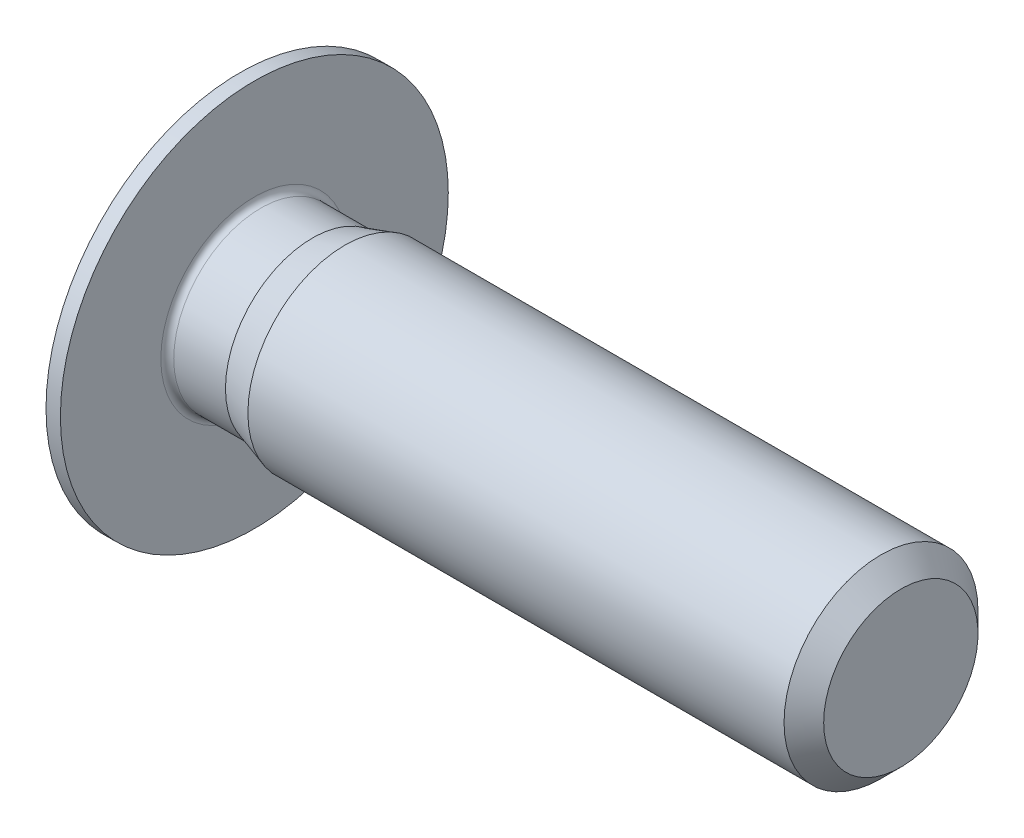
ISO-10303-21;
HEADER;
FILE_DESCRIPTION(('STEP AP214'),'2;1');
FILE_NAME('part.step','',(''),(''),'','','');
FILE_SCHEMA(('AUTOMOTIVE_DESIGN { 1 0 10303 214 1 1 1 1 }'));
ENDSEC;
DATA;
#1=APPLICATION_CONTEXT('core data for automotive mechanical design processes');
#2=APPLICATION_PROTOCOL_DEFINITION('international standard','automotive_design',2000,#1);
#3=PRODUCT_CONTEXT('',#1,'mechanical');
#4=PRODUCT('Part','Part','',(#3));
#5=PRODUCT_RELATED_PRODUCT_CATEGORY('part','',(#4));
#6=PRODUCT_DEFINITION_FORMATION('','',#4);
#7=PRODUCT_DEFINITION_CONTEXT('part definition',#1,'design');
#8=PRODUCT_DEFINITION('design','',#6,#7);
#9=PRODUCT_DEFINITION_SHAPE('','',#8);
#10=(LENGTH_UNIT() NAMED_UNIT(*) SI_UNIT(.MILLI.,.METRE.));
#11=(NAMED_UNIT(*) PLANE_ANGLE_UNIT() SI_UNIT($,.RADIAN.));
#12=(NAMED_UNIT(*) SI_UNIT($,.STERADIAN.) SOLID_ANGLE_UNIT());
#13=UNCERTAINTY_MEASURE_WITH_UNIT(LENGTH_MEASURE(1.E-05),#10,'distance_accuracy_value','');
#14=(GEOMETRIC_REPRESENTATION_CONTEXT(3) GLOBAL_UNCERTAINTY_ASSIGNED_CONTEXT((#13)) GLOBAL_UNIT_ASSIGNED_CONTEXT((#10,
#11,#12)) REPRESENTATION_CONTEXT('',''));
#15=CARTESIAN_POINT('',(0.,0.,0.));
#16=DIRECTION('',(0.,0.,1.));
#17=DIRECTION('',(1.,0.,0.));
#18=AXIS2_PLACEMENT_3D('',#15,#16,#17);
#19=CARTESIAN_POINT('',(-0.8,0.,0.));
#20=DIRECTION('',(1.,0.,0.));
#21=DIRECTION('',(0.,0.,-1.));
#22=AXIS2_PLACEMENT_3D('',#19,#20,#21);
#23=PLANE('',#22);
#24=CARTESIAN_POINT('',(-0.8,0.,0.));
#25=DIRECTION('',(-1.,0.,0.));
#26=DIRECTION('',(0.,0.,1.));
#27=AXIS2_PLACEMENT_3D('',#24,#25,#26);
#28=CIRCLE('',#27,2.);
#29=CARTESIAN_POINT('',(-0.8,0.,2.));
#30=VERTEX_POINT('',#29);
#31=EDGE_CURVE('E146',#30,#30,#28,.T.);
#32=ORIENTED_EDGE('',*,*,#31,.T.);
#33=EDGE_LOOP('',(#32));
#34=FACE_BOUND('',#33,.T.);
#35=DIRECTION('',(0.,0.500000000000001,-0.866025403784438));
#36=VECTOR('',#35,1.);
#37=CARTESIAN_POINT('',(-0.8,-0.86602540378444,0.));
#38=LINE('',#37,#36);
#39=CARTESIAN_POINT('',(-0.8,-0.86602540378444,0.));
#40=VERTEX_POINT('',#39);
#41=CARTESIAN_POINT('',(-0.8,-0.43301270189222,-0.75));
#42=VERTEX_POINT('',#41);
#43=EDGE_CURVE('E414',#40,#42,#38,.T.);
#44=ORIENTED_EDGE('',*,*,#43,.T.);
#45=DIRECTION('',(0.,1.,0.));
#46=VECTOR('',#45,1.);
#47=CARTESIAN_POINT('',(-0.8,-0.43301270189222,-0.75));
#48=LINE('',#47,#46);
#49=CARTESIAN_POINT('',(-0.8,0.43301270189222,-0.75));
#50=VERTEX_POINT('',#49);
#51=EDGE_CURVE('E416',#42,#50,#48,.T.);
#52=ORIENTED_EDGE('',*,*,#51,.T.);
#53=DIRECTION('',(0.,0.500000000000001,0.866025403784438));
#54=VECTOR('',#53,1.);
#55=CARTESIAN_POINT('',(-0.8,0.43301270189222,-0.75));
#56=LINE('',#55,#54);
#57=CARTESIAN_POINT('',(-0.8,0.86602540378444,0.));
#58=VERTEX_POINT('',#57);
#59=EDGE_CURVE('E418',#50,#58,#56,.T.);
#60=ORIENTED_EDGE('',*,*,#59,.T.);
#61=DIRECTION('',(0.,-0.500000000000001,0.866025403784438));
#62=VECTOR('',#61,1.);
#63=CARTESIAN_POINT('',(-0.8,0.86602540378444,0.));
#64=LINE('',#63,#62);
#65=CARTESIAN_POINT('',(-0.8,0.43301270189222,0.75));
#66=VERTEX_POINT('',#65);
#67=EDGE_CURVE('E120',#58,#66,#64,.T.);
#68=ORIENTED_EDGE('',*,*,#67,.T.);
#69=DIRECTION('',(0.,-1.,0.));
#70=VECTOR('',#69,1.);
#71=CARTESIAN_POINT('',(-0.8,0.43301270189222,0.75));
#72=LINE('',#71,#70);
#73=CARTESIAN_POINT('',(-0.8,-0.43301270189222,0.75));
#74=VERTEX_POINT('',#73);
#75=EDGE_CURVE('E411',#66,#74,#72,.T.);
#76=ORIENTED_EDGE('',*,*,#75,.T.);
#77=DIRECTION('',(0.,-0.500000000000001,-0.866025403784438));
#78=VECTOR('',#77,1.);
#79=CARTESIAN_POINT('',(-0.8,-0.43301270189222,0.75));
#80=LINE('',#79,#78);
#81=EDGE_CURVE('E135',#74,#40,#80,.T.);
#82=ORIENTED_EDGE('',*,*,#81,.T.);
#83=EDGE_LOOP('',(#44,#52,#60,#68,#76,#82));
#84=FACE_BOUND('',#83,.T.);
#85=ADVANCED_FACE('F36',(#34,#84),#23,.F.);
#86=CARTESIAN_POINT('',(10.,1.1935,0.));
#87=DIRECTION('',(-1.,0.,0.));
#88=DIRECTION('',(0.,0.,1.));
#89=AXIS2_PLACEMENT_3D('',#86,#87,#88);
#90=PLANE('',#89);
#91=CARTESIAN_POINT('',(10.,0.,0.));
#92=DIRECTION('',(-1.,0.,0.));
#93=DIRECTION('',(0.,0.,1.));
#94=AXIS2_PLACEMENT_3D('',#91,#92,#93);
#95=CIRCLE('',#94,1.1935);
#96=CARTESIAN_POINT('',(10.,0.,1.1935));
#97=VERTEX_POINT('',#96);
#98=EDGE_CURVE('E11',#97,#97,#95,.T.);
#99=ORIENTED_EDGE('',*,*,#98,.F.);
#100=EDGE_LOOP('',(#99));
#101=FACE_BOUND('',#100,.T.);
#102=ADVANCED_FACE('F38',(#101),#90,.F.);
#103=CARTESIAN_POINT('',(10.,0.,0.));
#104=DIRECTION('',(-1.,0.,0.));
#105=DIRECTION('',(0.,0.,1.));
#106=AXIS2_PLACEMENT_3D('',#103,#104,#105);
#107=CONICAL_SURFACE('',#106,1.1935,0.785398163397449);
#108=CARTESIAN_POINT('',(9.6935,0.,0.));
#109=DIRECTION('',(-1.,0.,0.));
#110=DIRECTION('',(0.,0.,1.));
#111=AXIS2_PLACEMENT_3D('',#108,#109,#110);
#112=CIRCLE('',#111,1.5);
#113=CARTESIAN_POINT('',(9.6935,0.,1.5));
#114=VERTEX_POINT('',#113);
#115=EDGE_CURVE('E44',#114,#114,#112,.T.);
#116=ORIENTED_EDGE('',*,*,#115,.F.);
#117=EDGE_LOOP('',(#116));
#118=FACE_BOUND('',#117,.T.);
#119=ORIENTED_EDGE('',*,*,#98,.T.);
#120=EDGE_LOOP('',(#119));
#121=FACE_BOUND('',#120,.T.);
#122=ADVANCED_FACE('F172',(#118,#121),#107,.T.);
#123=CARTESIAN_POINT('',(10.,0.,0.));
#124=DIRECTION('',(-1.,0.,0.));
#125=DIRECTION('',(0.,0.,1.));
#126=AXIS2_PLACEMENT_3D('',#123,#124,#125);
#127=CYLINDRICAL_SURFACE('',#126,1.5);
#128=CARTESIAN_POINT('',(1.4,0.,0.));
#129=DIRECTION('',(-1.,0.,0.));
#130=DIRECTION('',(0.,0.,1.));
#131=AXIS2_PLACEMENT_3D('',#128,#129,#130);
#132=CIRCLE('',#131,1.5);
#133=CARTESIAN_POINT('',(1.4,0.,1.5));
#134=VERTEX_POINT('',#133);
#135=EDGE_CURVE('E165',#134,#134,#132,.T.);
#136=ORIENTED_EDGE('',*,*,#135,.F.);
#137=EDGE_LOOP('',(#136));
#138=FACE_BOUND('',#137,.T.);
#139=ORIENTED_EDGE('',*,*,#115,.T.);
#140=EDGE_LOOP('',(#139));
#141=FACE_BOUND('',#140,.T.);
#142=ADVANCED_FACE('F170',(#138,#141),#127,.T.);
#143=CARTESIAN_POINT('',(1.4,0.,0.));
#144=DIRECTION('',(1.,0.,0.));
#145=DIRECTION('',(0.,0.,-1.));
#146=AXIS2_PLACEMENT_3D('',#143,#144,#145);
#147=CONICAL_SURFACE('',#146,1.5,0.297409377680196);
#148=CARTESIAN_POINT('',(0.9,0.,0.));
#149=DIRECTION('',(-1.,0.,0.));
#150=DIRECTION('',(0.,0.,1.));
#151=AXIS2_PLACEMENT_3D('',#148,#149,#150);
#152=CIRCLE('',#151,1.34675);
#153=CARTESIAN_POINT('',(0.9,0.,1.34675));
#154=VERTEX_POINT('',#153);
#155=EDGE_CURVE('E162',#154,#154,#152,.T.);
#156=ORIENTED_EDGE('',*,*,#155,.F.);
#157=EDGE_LOOP('',(#156));
#158=FACE_BOUND('',#157,.T.);
#159=ORIENTED_EDGE('',*,*,#135,.T.);
#160=EDGE_LOOP('',(#159));
#161=FACE_BOUND('',#160,.T.);
#162=ADVANCED_FACE('F209',(#158,#161),#147,.T.);
#163=CARTESIAN_POINT('',(10.,0.,0.));
#164=DIRECTION('',(-1.,0.,0.));
#165=DIRECTION('',(0.,0.,1.));
#166=AXIS2_PLACEMENT_3D('',#163,#164,#165);
#167=CYLINDRICAL_SURFACE('',#166,1.34675);
#168=CARTESIAN_POINT('',(0.0999999999999994,0.,0.));
#169=DIRECTION('',(-1.,0.,0.));
#170=DIRECTION('',(0.,0.,1.));
#171=AXIS2_PLACEMENT_3D('',#168,#169,#170);
#172=CIRCLE('',#171,1.34675);
#173=CARTESIAN_POINT('',(0.0999999999999994,0.,1.34675));
#174=VERTEX_POINT('',#173);
#175=EDGE_CURVE('E159',#174,#174,#172,.T.);
#176=ORIENTED_EDGE('',*,*,#175,.F.);
#177=EDGE_LOOP('',(#176));
#178=FACE_BOUND('',#177,.T.);
#179=ORIENTED_EDGE('',*,*,#155,.T.);
#180=EDGE_LOOP('',(#179));
#181=FACE_BOUND('',#180,.T.);
#182=ADVANCED_FACE('F205',(#178,#181),#167,.T.);
#183=CARTESIAN_POINT('',(0.0999999999999221,0.,0.));
#184=DIRECTION('',(-1.,0.,0.));
#185=DIRECTION('',(0.,0.,1.));
#186=AXIS2_PLACEMENT_3D('',#183,#184,#185);
#187=TOROIDAL_SURFACE('',#186,1.44674999999992,0.0999999999999222);
#188=CARTESIAN_POINT('',(0.,0.,0.));
#189=DIRECTION('',(-1.,0.,0.));
#190=DIRECTION('',(0.,0.,1.));
#191=AXIS2_PLACEMENT_3D('',#188,#189,#190);
#192=CIRCLE('',#191,1.44675);
#193=CARTESIAN_POINT('',(0.,0.,1.44675));
#194=VERTEX_POINT('',#193);
#195=EDGE_CURVE('E156',#194,#194,#192,.T.);
#196=ORIENTED_EDGE('',*,*,#195,.F.);
#197=EDGE_LOOP('',(#196));
#198=FACE_BOUND('',#197,.T.);
#199=ORIENTED_EDGE('',*,*,#175,.T.);
#200=EDGE_LOOP('',(#199));
#201=FACE_BOUND('',#200,.T.);
#202=ADVANCED_FACE('F201',(#198,#201),#187,.F.);
#203=CARTESIAN_POINT('',(0.,3.,0.));
#204=DIRECTION('',(-1.,0.,0.));
#205=DIRECTION('',(0.,0.,1.));
#206=AXIS2_PLACEMENT_3D('',#203,#204,#205);
#207=PLANE('',#206);
#208=CARTESIAN_POINT('',(0.,0.,0.));
#209=DIRECTION('',(-1.,0.,0.));
#210=DIRECTION('',(0.,0.,1.));
#211=AXIS2_PLACEMENT_3D('',#208,#209,#210);
#212=CIRCLE('',#211,3.);
#213=CARTESIAN_POINT('',(0.,0.,3.));
#214=VERTEX_POINT('',#213);
#215=EDGE_CURVE('E153',#214,#214,#212,.T.);
#216=ORIENTED_EDGE('',*,*,#215,.F.);
#217=EDGE_LOOP('',(#216));
#218=FACE_BOUND('',#217,.T.);
#219=ORIENTED_EDGE('',*,*,#195,.T.);
#220=EDGE_LOOP('',(#219));
#221=FACE_BOUND('',#220,.T.);
#222=ADVANCED_FACE('F197',(#218,#221),#207,.F.);
#223=CARTESIAN_POINT('',(10.,0.,0.));
#224=DIRECTION('',(-1.,0.,0.));
#225=DIRECTION('',(0.,0.,1.));
#226=AXIS2_PLACEMENT_3D('',#223,#224,#225);
#227=CYLINDRICAL_SURFACE('',#226,3.);
#228=CARTESIAN_POINT('',(-0.222649730810379,0.,0.));
#229=DIRECTION('',(-1.,0.,0.));
#230=DIRECTION('',(0.,0.,1.));
#231=AXIS2_PLACEMENT_3D('',#228,#229,#230);
#232=CIRCLE('',#231,3.);
#233=CARTESIAN_POINT('',(-0.222649730810379,0.,3.));
#234=VERTEX_POINT('',#233);
#235=EDGE_CURVE('E150',#234,#234,#232,.T.);
#236=ORIENTED_EDGE('',*,*,#235,.F.);
#237=EDGE_LOOP('',(#236));
#238=FACE_BOUND('',#237,.T.);
#239=ORIENTED_EDGE('',*,*,#215,.T.);
#240=EDGE_LOOP('',(#239));
#241=FACE_BOUND('',#240,.T.);
#242=ADVANCED_FACE('F193',(#238,#241),#227,.T.);
#243=CARTESIAN_POINT('',(-0.222649730810379,0.,0.));
#244=DIRECTION('',(1.,0.,0.));
#245=DIRECTION('',(0.,0.,-1.));
#246=AXIS2_PLACEMENT_3D('',#243,#244,#245);
#247=CONICAL_SURFACE('',#246,3.,1.0471975511966);
#248=ORIENTED_EDGE('',*,*,#31,.F.);
#249=EDGE_LOOP('',(#248));
#250=FACE_BOUND('',#249,.T.);
#251=ORIENTED_EDGE('',*,*,#235,.T.);
#252=EDGE_LOOP('',(#251));
#253=FACE_BOUND('',#252,.T.);
#254=ADVANCED_FACE('F190',(#250,#253),#247,.T.);
#255=CARTESIAN_POINT('',(1.2,0.43301270189222,0.75));
#256=DIRECTION('',(0.,0.,-1.));
#257=DIRECTION('',(-1.,0.,0.));
#258=AXIS2_PLACEMENT_3D('',#255,#256,#257);
#259=PLANE('',#258);
#260=DIRECTION('',(0.,-1.,0.));
#261=VECTOR('',#260,1.);
#262=CARTESIAN_POINT('',(1.2,0.43301270189222,0.75));
#263=LINE('',#262,#261);
#264=CARTESIAN_POINT('',(1.2,0.43301270189222,0.75));
#265=VERTEX_POINT('',#264);
#266=CARTESIAN_POINT('',(1.2,0.,0.75));
#267=VERTEX_POINT('',#266);
#268=EDGE_CURVE('E117',#265,#267,#263,.T.);
#269=ORIENTED_EDGE('',*,*,#268,.T.);
#270=CARTESIAN_POINT('',(1.2,-0.43301270189222,0.75));
#271=VERTEX_POINT('',#270);
#272=EDGE_CURVE('E109',#267,#271,#263,.T.);
#273=ORIENTED_EDGE('',*,*,#272,.T.);
#274=DIRECTION('',(-1.,0.,0.));
#275=VECTOR('',#274,1.);
#276=CARTESIAN_POINT('',(1.2,-0.43301270189222,0.75));
#277=LINE('',#276,#275);
#278=EDGE_CURVE('E114',#271,#74,#277,.T.);
#279=ORIENTED_EDGE('',*,*,#278,.T.);
#280=ORIENTED_EDGE('',*,*,#75,.F.);
#281=DIRECTION('',(-1.,0.,0.));
#282=VECTOR('',#281,1.);
#283=CARTESIAN_POINT('',(1.2,0.43301270189222,0.75));
#284=LINE('',#283,#282);
#285=EDGE_CURVE('E406',#265,#66,#284,.T.);
#286=ORIENTED_EDGE('',*,*,#285,.F.);
#287=EDGE_LOOP('',(#269,#273,#279,#280,#286));
#288=FACE_BOUND('',#287,.T.);
#289=ADVANCED_FACE('F111',(#288),#259,.T.);
#290=CARTESIAN_POINT('',(1.2,-0.43301270189222,0.75));
#291=DIRECTION('',(0.,0.866025403784438,-0.500000000000001));
#292=DIRECTION('',(0.,0.500000000000001,0.866025403784438));
#293=AXIS2_PLACEMENT_3D('',#290,#291,#292);
#294=PLANE('',#293);
#295=DIRECTION('',(0.,-0.500000000000001,-0.866025403784438));
#296=VECTOR('',#295,1.);
#297=CARTESIAN_POINT('',(1.2,-0.43301270189222,0.75));
#298=LINE('',#297,#296);
#299=CARTESIAN_POINT('',(1.2,-0.64951905283833,0.375000000000001));
#300=VERTEX_POINT('',#299);
#301=EDGE_CURVE('E123',#271,#300,#298,.T.);
#302=ORIENTED_EDGE('',*,*,#301,.T.);
#303=CARTESIAN_POINT('',(1.2,-0.86602540378444,0.));
#304=VERTEX_POINT('',#303);
#305=EDGE_CURVE('E130',#300,#304,#298,.T.);
#306=ORIENTED_EDGE('',*,*,#305,.T.);
#307=DIRECTION('',(-1.,0.,0.));
#308=VECTOR('',#307,1.);
#309=CARTESIAN_POINT('',(1.2,-0.86602540378444,0.));
#310=LINE('',#309,#308);
#311=EDGE_CURVE('E136',#304,#40,#310,.T.);
#312=ORIENTED_EDGE('',*,*,#311,.T.);
#313=ORIENTED_EDGE('',*,*,#81,.F.);
#314=ORIENTED_EDGE('',*,*,#278,.F.);
#315=EDGE_LOOP('',(#302,#306,#312,#313,#314));
#316=FACE_BOUND('',#315,.T.);
#317=ADVANCED_FACE('F133',(#316),#294,.T.);
#318=CARTESIAN_POINT('',(1.2,-0.86602540378444,0.));
#319=DIRECTION('',(0.,0.866025403784438,0.500000000000001));
#320=DIRECTION('',(0.,-0.500000000000001,0.866025403784438));
#321=AXIS2_PLACEMENT_3D('',#318,#319,#320);
#322=PLANE('',#321);
#323=DIRECTION('',(0.,0.500000000000001,-0.866025403784438));
#324=VECTOR('',#323,1.);
#325=CARTESIAN_POINT('',(1.2,-0.86602540378444,0.));
#326=LINE('',#325,#324);
#327=CARTESIAN_POINT('',(1.2,-0.64951905283832,-0.374999999999995));
#328=VERTEX_POINT('',#327);
#329=EDGE_CURVE('E51',#304,#328,#326,.T.);
#330=ORIENTED_EDGE('',*,*,#329,.T.);
#331=CARTESIAN_POINT('',(1.2,-0.43301270189222,-0.75));
#332=VERTEX_POINT('',#331);
#333=EDGE_CURVE('E129',#328,#332,#326,.T.);
#334=ORIENTED_EDGE('',*,*,#333,.T.);
#335=DIRECTION('',(-1.,0.,0.));
#336=VECTOR('',#335,1.);
#337=CARTESIAN_POINT('',(1.2,-0.43301270189222,-0.75));
#338=LINE('',#337,#336);
#339=EDGE_CURVE('E141',#332,#42,#338,.T.);
#340=ORIENTED_EDGE('',*,*,#339,.T.);
#341=ORIENTED_EDGE('',*,*,#43,.F.);
#342=ORIENTED_EDGE('',*,*,#311,.F.);
#343=EDGE_LOOP('',(#330,#334,#340,#341,#342));
#344=FACE_BOUND('',#343,.T.);
#345=ADVANCED_FACE('F257',(#344),#322,.T.);
#346=CARTESIAN_POINT('',(1.2,-0.43301270189222,-0.75));
#347=DIRECTION('',(0.,0.,1.));
#348=DIRECTION('',(1.,0.,0.));
#349=AXIS2_PLACEMENT_3D('',#346,#347,#348);
#350=PLANE('',#349);
#351=DIRECTION('',(0.,1.,0.));
#352=VECTOR('',#351,1.);
#353=CARTESIAN_POINT('',(1.2,-0.43301270189222,-0.75));
#354=LINE('',#353,#352);
#355=CARTESIAN_POINT('',(1.2,0.,-0.75));
#356=VERTEX_POINT('',#355);
#357=EDGE_CURVE('E436',#332,#356,#354,.T.);
#358=ORIENTED_EDGE('',*,*,#357,.T.);
#359=CARTESIAN_POINT('',(1.2,0.43301270189222,-0.75));
#360=VERTEX_POINT('',#359);
#361=EDGE_CURVE('E434',#356,#360,#354,.T.);
#362=ORIENTED_EDGE('',*,*,#361,.T.);
#363=DIRECTION('',(-1.,0.,0.));
#364=VECTOR('',#363,1.);
#365=CARTESIAN_POINT('',(1.2,0.43301270189222,-0.75));
#366=LINE('',#365,#364);
#367=EDGE_CURVE('E422',#360,#50,#366,.T.);
#368=ORIENTED_EDGE('',*,*,#367,.T.);
#369=ORIENTED_EDGE('',*,*,#51,.F.);
#370=ORIENTED_EDGE('',*,*,#339,.F.);
#371=EDGE_LOOP('',(#358,#362,#368,#369,#370));
#372=FACE_BOUND('',#371,.T.);
#373=ADVANCED_FACE('F264',(#372),#350,.T.);
#374=CARTESIAN_POINT('',(1.2,0.43301270189222,-0.75));
#375=DIRECTION('',(0.,-0.866025403784438,0.500000000000001));
#376=DIRECTION('',(0.,-0.500000000000001,-0.866025403784438));
#377=AXIS2_PLACEMENT_3D('',#374,#375,#376);
#378=PLANE('',#377);
#379=DIRECTION('',(0.,0.500000000000001,0.866025403784438));
#380=VECTOR('',#379,1.);
#381=CARTESIAN_POINT('',(1.2,0.43301270189222,-0.75));
#382=LINE('',#381,#380);
#383=CARTESIAN_POINT('',(1.2,0.64951905283833,-0.375000000000001));
#384=VERTEX_POINT('',#383);
#385=EDGE_CURVE('E398',#360,#384,#382,.T.);
#386=ORIENTED_EDGE('',*,*,#385,.T.);
#387=CARTESIAN_POINT('',(1.2,0.86602540378444,0.));
#388=VERTEX_POINT('',#387);
#389=EDGE_CURVE('E437',#384,#388,#382,.T.);
#390=ORIENTED_EDGE('',*,*,#389,.T.);
#391=DIRECTION('',(-1.,0.,0.));
#392=VECTOR('',#391,1.);
#393=CARTESIAN_POINT('',(1.2,0.86602540378444,0.));
#394=LINE('',#393,#392);
#395=EDGE_CURVE('E404',#388,#58,#394,.T.);
#396=ORIENTED_EDGE('',*,*,#395,.T.);
#397=ORIENTED_EDGE('',*,*,#59,.F.);
#398=ORIENTED_EDGE('',*,*,#367,.F.);
#399=EDGE_LOOP('',(#386,#390,#396,#397,#398));
#400=FACE_BOUND('',#399,.T.);
#401=ADVANCED_FACE('F271',(#400),#378,.T.);
#402=CARTESIAN_POINT('',(1.2,0.86602540378444,0.));
#403=DIRECTION('',(0.,-0.866025403784438,-0.500000000000001));
#404=DIRECTION('',(0.,0.500000000000001,-0.866025403784438));
#405=AXIS2_PLACEMENT_3D('',#402,#403,#404);
#406=PLANE('',#405);
#407=DIRECTION('',(0.,-0.500000000000001,0.866025403784438));
#408=VECTOR('',#407,1.);
#409=CARTESIAN_POINT('',(1.2,0.86602540378444,0.));
#410=LINE('',#409,#408);
#411=CARTESIAN_POINT('',(1.2,0.64951905283833,0.375000000000001));
#412=VERTEX_POINT('',#411);
#413=EDGE_CURVE('E397',#388,#412,#410,.T.);
#414=ORIENTED_EDGE('',*,*,#413,.T.);
#415=EDGE_CURVE('E394',#412,#265,#410,.T.);
#416=ORIENTED_EDGE('',*,*,#415,.T.);
#417=ORIENTED_EDGE('',*,*,#285,.T.);
#418=ORIENTED_EDGE('',*,*,#67,.F.);
#419=ORIENTED_EDGE('',*,*,#395,.F.);
#420=EDGE_LOOP('',(#414,#416,#417,#418,#419));
#421=FACE_BOUND('',#420,.T.);
#422=ADVANCED_FACE('F279',(#421),#406,.T.);
#423=CARTESIAN_POINT('',(1.2,0.,0.));
#424=DIRECTION('',(1.,0.,0.));
#425=DIRECTION('',(0.,0.,-1.));
#426=AXIS2_PLACEMENT_3D('',#423,#424,#425);
#427=PLANE('',#426);
#428=CARTESIAN_POINT('',(1.2,0.,0.));
#429=DIRECTION('',(-1.,0.,0.));
#430=DIRECTION('',(0.,0.,1.));
#431=AXIS2_PLACEMENT_3D('',#428,#429,#430);
#432=CIRCLE('',#431,0.74999999999999);
#433=EDGE_CURVE('E441',#384,#356,#432,.T.);
#434=ORIENTED_EDGE('',*,*,#433,.F.);
#435=ORIENTED_EDGE('',*,*,#385,.F.);
#436=ORIENTED_EDGE('',*,*,#361,.F.);
#437=EDGE_LOOP('',(#434,#435,#436));
#438=FACE_BOUND('',#437,.T.);
#439=ADVANCED_FACE('F287',(#438),#427,.F.);
#440=EDGE_CURVE('E147',#412,#384,#432,.T.);
#441=ORIENTED_EDGE('',*,*,#440,.F.);
#442=ORIENTED_EDGE('',*,*,#413,.F.);
#443=ORIENTED_EDGE('',*,*,#389,.F.);
#444=EDGE_LOOP('',(#441,#442,#443));
#445=FACE_BOUND('',#444,.T.);
#446=ADVANCED_FACE('F295',(#445),#427,.F.);
#447=EDGE_CURVE('E140',#267,#412,#432,.T.);
#448=ORIENTED_EDGE('',*,*,#447,.F.);
#449=ORIENTED_EDGE('',*,*,#268,.F.);
#450=ORIENTED_EDGE('',*,*,#415,.F.);
#451=EDGE_LOOP('',(#448,#449,#450));
#452=FACE_BOUND('',#451,.T.);
#453=ADVANCED_FACE('F304',(#452),#427,.F.);
#454=EDGE_CURVE('E125',#300,#267,#432,.T.);
#455=ORIENTED_EDGE('',*,*,#454,.F.);
#456=ORIENTED_EDGE('',*,*,#301,.F.);
#457=ORIENTED_EDGE('',*,*,#272,.F.);
#458=EDGE_LOOP('',(#455,#456,#457));
#459=FACE_BOUND('',#458,.T.);
#460=ADVANCED_FACE('F124',(#459),#427,.F.);
#461=EDGE_CURVE('E138',#328,#300,#432,.T.);
#462=ORIENTED_EDGE('',*,*,#461,.F.);
#463=ORIENTED_EDGE('',*,*,#329,.F.);
#464=ORIENTED_EDGE('',*,*,#305,.F.);
#465=EDGE_LOOP('',(#462,#463,#464));
#466=FACE_BOUND('',#465,.T.);
#467=ADVANCED_FACE('F317',(#466),#427,.F.);
#468=EDGE_CURVE('E442',#356,#328,#432,.T.);
#469=ORIENTED_EDGE('',*,*,#468,.F.);
#470=ORIENTED_EDGE('',*,*,#357,.F.);
#471=ORIENTED_EDGE('',*,*,#333,.F.);
#472=EDGE_LOOP('',(#469,#470,#471));
#473=FACE_BOUND('',#472,.T.);
#474=ADVANCED_FACE('F298',(#473),#427,.F.);
#475=CARTESIAN_POINT('',(1.6330127018922,0.,0.));
#476=DIRECTION('',(-1.,0.,0.));
#477=DIRECTION('',(0.,0.,1.));
#478=AXIS2_PLACEMENT_3D('',#475,#476,#477);
#479=CONICAL_SURFACE('',#478,0.,1.04719755119661);
#480=ORIENTED_EDGE('',*,*,#447,.T.);
#481=ORIENTED_EDGE('',*,*,#440,.T.);
#482=ORIENTED_EDGE('',*,*,#433,.T.);
#483=ORIENTED_EDGE('',*,*,#468,.T.);
#484=ORIENTED_EDGE('',*,*,#461,.T.);
#485=ORIENTED_EDGE('',*,*,#454,.T.);
#486=EDGE_LOOP('',(#480,#481,#482,#483,#484,#485));
#487=FACE_BOUND('',#486,.T.);
#488=CARTESIAN_POINT('',(1.6330127018922,0.,0.));
#489=VERTEX_POINT('',#488);
#490=VERTEX_LOOP('',#489);
#491=FACE_BOUND('',#490,.T.);
#492=ADVANCED_FACE('F188',(#487,#491),#479,.F.);
#493=CLOSED_SHELL('',(#85,#102,#122,#142,#162,#182,#202,#222,#242,#254,#289,#317,#345,#373,#401,
#422,#439,#446,#453,#460,#467,#474,#492));
#494=MANIFOLD_SOLID_BREP('B2',#493);
#495=ADVANCED_BREP_SHAPE_REPRESENTATION('',(#18,#494),#14);
#496=SHAPE_DEFINITION_REPRESENTATION(#9,#495);
ENDSEC;
END-ISO-10303-21;
